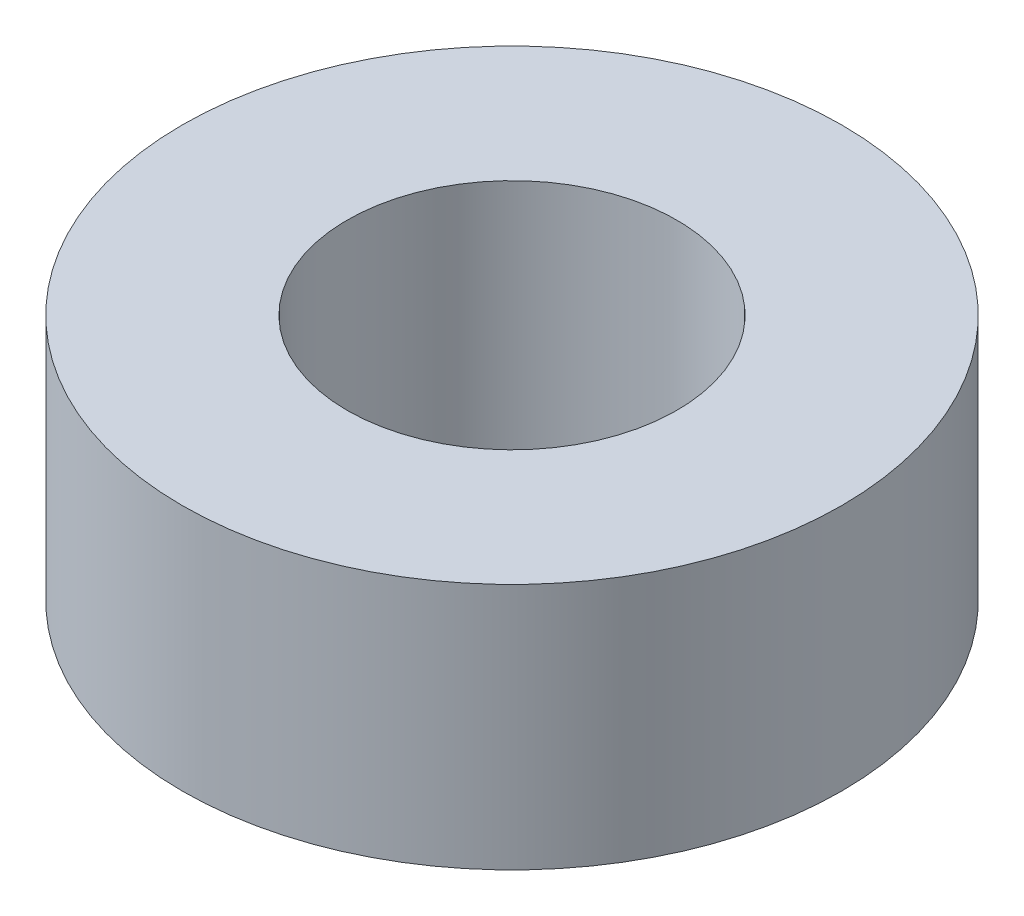
ISO-10303-21;
HEADER;
FILE_DESCRIPTION(('STEP AP214'),'2;1');
FILE_NAME('part.step','',(''),(''),'','','');
FILE_SCHEMA(('AUTOMOTIVE_DESIGN { 1 0 10303 214 1 1 1 1 }'));
ENDSEC;
DATA;
#1=APPLICATION_CONTEXT('core data for automotive mechanical design processes');
#2=APPLICATION_PROTOCOL_DEFINITION('international standard','automotive_design',2000,#1);
#3=PRODUCT_CONTEXT('',#1,'mechanical');
#4=PRODUCT('Part','Part','',(#3));
#5=PRODUCT_RELATED_PRODUCT_CATEGORY('part','',(#4));
#6=PRODUCT_DEFINITION_FORMATION('','',#4);
#7=PRODUCT_DEFINITION_CONTEXT('part definition',#1,'design');
#8=PRODUCT_DEFINITION('design','',#6,#7);
#9=PRODUCT_DEFINITION_SHAPE('','',#8);
#10=(LENGTH_UNIT() NAMED_UNIT(*) SI_UNIT(.MILLI.,.METRE.));
#11=(NAMED_UNIT(*) PLANE_ANGLE_UNIT() SI_UNIT($,.RADIAN.));
#12=(NAMED_UNIT(*) SI_UNIT($,.STERADIAN.) SOLID_ANGLE_UNIT());
#13=UNCERTAINTY_MEASURE_WITH_UNIT(LENGTH_MEASURE(1.E-05),#10,'distance_accuracy_value','');
#14=(GEOMETRIC_REPRESENTATION_CONTEXT(3) GLOBAL_UNCERTAINTY_ASSIGNED_CONTEXT((#13)) GLOBAL_UNIT_ASSIGNED_CONTEXT((#10,
#11,#12)) REPRESENTATION_CONTEXT('',''));
#15=CARTESIAN_POINT('',(0.,0.,0.));
#16=DIRECTION('',(0.,0.,1.));
#17=DIRECTION('',(1.,0.,0.));
#18=AXIS2_PLACEMENT_3D('',#15,#16,#17);
#19=CARTESIAN_POINT('',(0.,-2.38125,0.));
#20=DIRECTION('',(0.,1.,0.));
#21=DIRECTION('',(1.,0.,0.));
#22=AXIS2_PLACEMENT_3D('',#19,#20,#21);
#23=PLANE('',#22);
#24=CARTESIAN_POINT('',(0.,-2.38125,0.));
#25=DIRECTION('',(0.,1.,0.));
#26=DIRECTION('',(0.,0.,1.));
#27=AXIS2_PLACEMENT_3D('',#24,#25,#26);
#28=CIRCLE('',#27,3.175);
#29=CARTESIAN_POINT('',(0.,-2.38125,3.175));
#30=VERTEX_POINT('',#29);
#31=EDGE_CURVE('E33',#30,#30,#28,.T.);
#32=ORIENTED_EDGE('',*,*,#31,.T.);
#33=EDGE_LOOP('',(#32));
#34=FACE_BOUND('',#33,.T.);
#35=CARTESIAN_POINT('',(0.,-2.38125,0.));
#36=DIRECTION('',(0.,1.,0.));
#37=DIRECTION('',(0.,0.,1.));
#38=AXIS2_PLACEMENT_3D('',#35,#36,#37);
#39=CIRCLE('',#38,6.35);
#40=CARTESIAN_POINT('',(0.,-2.38125,6.35));
#41=VERTEX_POINT('',#40);
#42=EDGE_CURVE('E10',#41,#41,#39,.T.);
#43=ORIENTED_EDGE('',*,*,#42,.F.);
#44=EDGE_LOOP('',(#43));
#45=FACE_BOUND('',#44,.T.);
#46=ADVANCED_FACE('F14',(#34,#45),#23,.F.);
#47=CARTESIAN_POINT('',(0.,2.38125,0.));
#48=DIRECTION('',(0.,1.,0.));
#49=DIRECTION('',(1.,0.,0.));
#50=AXIS2_PLACEMENT_3D('',#47,#48,#49);
#51=PLANE('',#50);
#52=CARTESIAN_POINT('',(0.,2.38125,0.));
#53=DIRECTION('',(0.,1.,0.));
#54=DIRECTION('',(0.,0.,1.));
#55=AXIS2_PLACEMENT_3D('',#52,#53,#54);
#56=CIRCLE('',#55,3.175);
#57=CARTESIAN_POINT('',(0.,2.38125,3.175));
#58=VERTEX_POINT('',#57);
#59=EDGE_CURVE('E36',#58,#58,#56,.T.);
#60=ORIENTED_EDGE('',*,*,#59,.F.);
#61=EDGE_LOOP('',(#60));
#62=FACE_BOUND('',#61,.T.);
#63=CARTESIAN_POINT('',(0.,2.38125,0.));
#64=DIRECTION('',(0.,1.,0.));
#65=DIRECTION('',(0.,0.,1.));
#66=AXIS2_PLACEMENT_3D('',#63,#64,#65);
#67=CIRCLE('',#66,6.35);
#68=CARTESIAN_POINT('',(0.,2.38125,6.35));
#69=VERTEX_POINT('',#68);
#70=EDGE_CURVE('E22',#69,#69,#67,.T.);
#71=ORIENTED_EDGE('',*,*,#70,.T.);
#72=EDGE_LOOP('',(#71));
#73=FACE_BOUND('',#72,.T.);
#74=ADVANCED_FACE('F16',(#62,#73),#51,.T.);
#75=CARTESIAN_POINT('',(0.,2.38125,0.));
#76=DIRECTION('',(0.,-1.,0.));
#77=DIRECTION('',(0.,0.,-1.));
#78=AXIS2_PLACEMENT_3D('',#75,#76,#77);
#79=CYLINDRICAL_SURFACE('',#78,6.35);
#80=ORIENTED_EDGE('',*,*,#42,.T.);
#81=EDGE_LOOP('',(#80));
#82=FACE_BOUND('',#81,.T.);
#83=ORIENTED_EDGE('',*,*,#70,.F.);
#84=EDGE_LOOP('',(#83));
#85=FACE_BOUND('',#84,.T.);
#86=ADVANCED_FACE('F49',(#82,#85),#79,.T.);
#87=CARTESIAN_POINT('',(0.,2.38125,0.));
#88=DIRECTION('',(0.,-1.,0.));
#89=DIRECTION('',(0.,0.,-1.));
#90=AXIS2_PLACEMENT_3D('',#87,#88,#89);
#91=CYLINDRICAL_SURFACE('',#90,3.175);
#92=ORIENTED_EDGE('',*,*,#31,.F.);
#93=EDGE_LOOP('',(#92));
#94=FACE_BOUND('',#93,.T.);
#95=ORIENTED_EDGE('',*,*,#59,.T.);
#96=EDGE_LOOP('',(#95));
#97=FACE_BOUND('',#96,.T.);
#98=ADVANCED_FACE('F50',(#94,#97),#91,.F.);
#99=CLOSED_SHELL('',(#46,#74,#86,#98));
#100=MANIFOLD_SOLID_BREP('B1',#99);
#101=ADVANCED_BREP_SHAPE_REPRESENTATION('',(#18,#100),#14);
#102=SHAPE_DEFINITION_REPRESENTATION(#9,#101);
ENDSEC;
END-ISO-10303-21;
